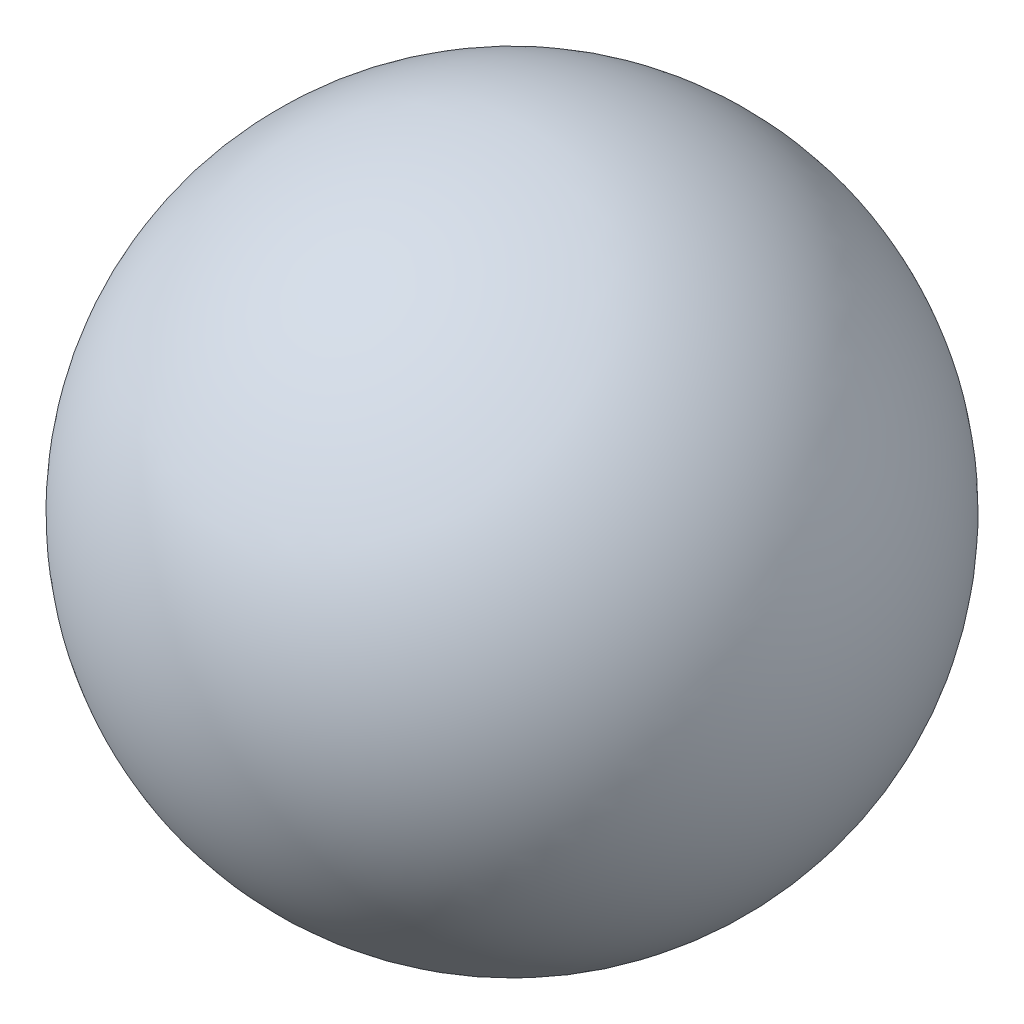
ISO-10303-21;
HEADER;
FILE_DESCRIPTION(('STEP AP214'),'2;1');
FILE_NAME('part.step','',(''),(''),'','','');
FILE_SCHEMA(('AUTOMOTIVE_DESIGN { 1 0 10303 214 1 1 1 1 }'));
ENDSEC;
DATA;
#1=APPLICATION_CONTEXT('core data for automotive mechanical design processes');
#2=APPLICATION_PROTOCOL_DEFINITION('international standard','automotive_design',2000,#1);
#3=PRODUCT_CONTEXT('',#1,'mechanical');
#4=PRODUCT('Part','Part','',(#3));
#5=PRODUCT_RELATED_PRODUCT_CATEGORY('part','',(#4));
#6=PRODUCT_DEFINITION_FORMATION('','',#4);
#7=PRODUCT_DEFINITION_CONTEXT('part definition',#1,'design');
#8=PRODUCT_DEFINITION('design','',#6,#7);
#9=PRODUCT_DEFINITION_SHAPE('','',#8);
#10=(LENGTH_UNIT() NAMED_UNIT(*) SI_UNIT(.MILLI.,.METRE.));
#11=(NAMED_UNIT(*) PLANE_ANGLE_UNIT() SI_UNIT($,.RADIAN.));
#12=(NAMED_UNIT(*) SI_UNIT($,.STERADIAN.) SOLID_ANGLE_UNIT());
#13=UNCERTAINTY_MEASURE_WITH_UNIT(LENGTH_MEASURE(1.E-05),#10,'distance_accuracy_value','');
#14=(GEOMETRIC_REPRESENTATION_CONTEXT(3) GLOBAL_UNCERTAINTY_ASSIGNED_CONTEXT((#13)) GLOBAL_UNIT_ASSIGNED_CONTEXT((#10,
#11,#12)) REPRESENTATION_CONTEXT('',''));
#15=CARTESIAN_POINT('',(0.,0.,0.));
#16=DIRECTION('',(0.,0.,1.));
#17=DIRECTION('',(1.,0.,0.));
#18=AXIS2_PLACEMENT_3D('',#15,#16,#17);
#19=CARTESIAN_POINT('',(11.7366912354003,-2.,0.559087510928994));
#20=DIRECTION('',(0.,0.,1.));
#21=DIRECTION('',(1.,0.,0.));
#22=AXIS2_PLACEMENT_3D('',#19,#20,#21);
#23=SPHERICAL_SURFACE('',#22,1.05);
#24=CARTESIAN_POINT('',(11.7366912354003,-2.,1.60908751092899));
#25=VERTEX_POINT('',#24);
#26=VERTEX_LOOP('',#25);
#27=FACE_BOUND('',#26,.T.);
#28=ADVANCED_FACE('F13',(#27),#23,.T.);
#29=CLOSED_SHELL('',(#28));
#30=MANIFOLD_SOLID_BREP('B1',#29);
#31=ADVANCED_BREP_SHAPE_REPRESENTATION('',(#18,#30),#14);
#32=SHAPE_DEFINITION_REPRESENTATION(#9,#31);
ENDSEC;
END-ISO-10303-21;
